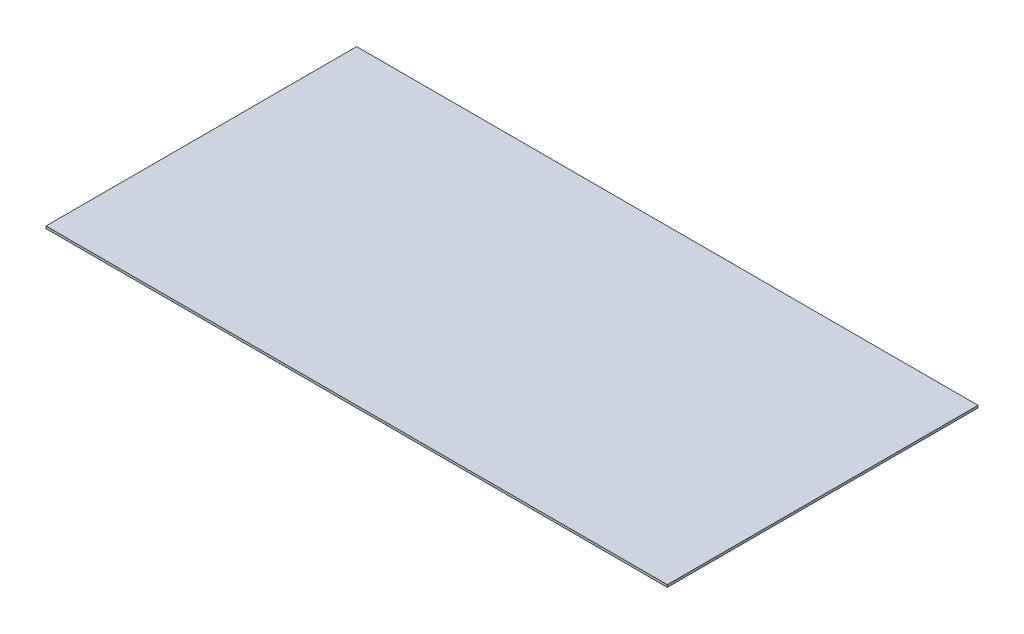
ISO-10303-21;
HEADER;
FILE_DESCRIPTION(('STEP AP214'),'2;1');
FILE_NAME('part.step','',(''),(''),'','','');
FILE_SCHEMA(('AUTOMOTIVE_DESIGN { 1 0 10303 214 1 1 1 1 }'));
ENDSEC;
DATA;
#1=APPLICATION_CONTEXT('core data for automotive mechanical design processes');
#2=APPLICATION_PROTOCOL_DEFINITION('international standard','automotive_design',2000,#1);
#3=PRODUCT_CONTEXT('',#1,'mechanical');
#4=PRODUCT('Part','Part','',(#3));
#5=PRODUCT_RELATED_PRODUCT_CATEGORY('part','',(#4));
#6=PRODUCT_DEFINITION_FORMATION('','',#4);
#7=PRODUCT_DEFINITION_CONTEXT('part definition',#1,'design');
#8=PRODUCT_DEFINITION('design','',#6,#7);
#9=PRODUCT_DEFINITION_SHAPE('','',#8);
#10=(LENGTH_UNIT() NAMED_UNIT(*) SI_UNIT(.MILLI.,.METRE.));
#11=(NAMED_UNIT(*) PLANE_ANGLE_UNIT() SI_UNIT($,.RADIAN.));
#12=(NAMED_UNIT(*) SI_UNIT($,.STERADIAN.) SOLID_ANGLE_UNIT());
#13=UNCERTAINTY_MEASURE_WITH_UNIT(LENGTH_MEASURE(1.E-05),#10,'distance_accuracy_value','');
#14=(GEOMETRIC_REPRESENTATION_CONTEXT(3) GLOBAL_UNCERTAINTY_ASSIGNED_CONTEXT((#13)) GLOBAL_UNIT_ASSIGNED_CONTEXT((#10,
#11,#12)) REPRESENTATION_CONTEXT('',''));
#15=CARTESIAN_POINT('',(0.,0.,0.));
#16=DIRECTION('',(0.,0.,1.));
#17=DIRECTION('',(1.,0.,0.));
#18=AXIS2_PLACEMENT_3D('',#15,#16,#17);
#19=CARTESIAN_POINT('',(0.,3.,0.));
#20=DIRECTION('',(1.,0.,0.));
#21=DIRECTION('',(0.,0.,-1.));
#22=AXIS2_PLACEMENT_3D('',#19,#20,#21);
#23=PLANE('',#22);
#24=DIRECTION('',(0.,0.,1.));
#25=VECTOR('',#24,1.);
#26=CARTESIAN_POINT('',(0.,0.,0.));
#27=LINE('',#26,#25);
#28=CARTESIAN_POINT('',(0.,0.,-400.));
#29=VERTEX_POINT('',#28);
#30=CARTESIAN_POINT('',(0.,0.,0.));
#31=VERTEX_POINT('',#30);
#32=EDGE_CURVE('E96',#29,#31,#27,.T.);
#33=ORIENTED_EDGE('',*,*,#32,.T.);
#34=DIRECTION('',(0.,-1.,0.));
#35=VECTOR('',#34,1.);
#36=CARTESIAN_POINT('',(0.,3.,0.));
#37=LINE('',#36,#35);
#38=CARTESIAN_POINT('',(0.,3.,0.));
#39=VERTEX_POINT('',#38);
#40=EDGE_CURVE('E11',#39,#31,#37,.T.);
#41=ORIENTED_EDGE('',*,*,#40,.F.);
#42=DIRECTION('',(0.,0.,1.));
#43=VECTOR('',#42,1.);
#44=CARTESIAN_POINT('',(0.,3.,0.));
#45=LINE('',#44,#43);
#46=CARTESIAN_POINT('',(0.,3.,-400.));
#47=VERTEX_POINT('',#46);
#48=EDGE_CURVE('E84',#47,#39,#45,.T.);
#49=ORIENTED_EDGE('',*,*,#48,.F.);
#50=DIRECTION('',(0.,-1.,0.));
#51=VECTOR('',#50,1.);
#52=CARTESIAN_POINT('',(0.,3.,-400.));
#53=LINE('',#52,#51);
#54=EDGE_CURVE('E92',#47,#29,#53,.T.);
#55=ORIENTED_EDGE('',*,*,#54,.T.);
#56=EDGE_LOOP('',(#33,#41,#49,#55));
#57=FACE_BOUND('',#56,.T.);
#58=ADVANCED_FACE('F33',(#57),#23,.F.);
#59=CARTESIAN_POINT('',(0.,3.,0.));
#60=DIRECTION('',(0.,0.,-1.));
#61=DIRECTION('',(-1.,0.,0.));
#62=AXIS2_PLACEMENT_3D('',#59,#60,#61);
#63=PLANE('',#62);
#64=DIRECTION('',(1.,0.,0.));
#65=VECTOR('',#64,1.);
#66=CARTESIAN_POINT('',(0.,0.,0.));
#67=LINE('',#66,#65);
#68=CARTESIAN_POINT('',(800.,0.,0.));
#69=VERTEX_POINT('',#68);
#70=EDGE_CURVE('E88',#31,#69,#67,.T.);
#71=ORIENTED_EDGE('',*,*,#70,.T.);
#72=DIRECTION('',(0.,-1.,0.));
#73=VECTOR('',#72,1.);
#74=CARTESIAN_POINT('',(800.,3.,0.));
#75=LINE('',#74,#73);
#76=CARTESIAN_POINT('',(800.,3.,0.));
#77=VERTEX_POINT('',#76);
#78=EDGE_CURVE('E41',#77,#69,#75,.T.);
#79=ORIENTED_EDGE('',*,*,#78,.F.);
#80=DIRECTION('',(1.,0.,0.));
#81=VECTOR('',#80,1.);
#82=CARTESIAN_POINT('',(0.,3.,0.));
#83=LINE('',#82,#81);
#84=EDGE_CURVE('E79',#39,#77,#83,.T.);
#85=ORIENTED_EDGE('',*,*,#84,.F.);
#86=ORIENTED_EDGE('',*,*,#40,.T.);
#87=EDGE_LOOP('',(#71,#79,#85,#86));
#88=FACE_BOUND('',#87,.T.);
#89=ADVANCED_FACE('F87',(#88),#63,.F.);
#90=CARTESIAN_POINT('',(800.,3.,0.));
#91=DIRECTION('',(-1.,0.,0.));
#92=DIRECTION('',(0.,0.,1.));
#93=AXIS2_PLACEMENT_3D('',#90,#91,#92);
#94=PLANE('',#93);
#95=DIRECTION('',(0.,0.,-1.));
#96=VECTOR('',#95,1.);
#97=CARTESIAN_POINT('',(800.,0.,0.));
#98=LINE('',#97,#96);
#99=CARTESIAN_POINT('',(800.,0.,-400.));
#100=VERTEX_POINT('',#99);
#101=EDGE_CURVE('E66',#69,#100,#98,.T.);
#102=ORIENTED_EDGE('',*,*,#101,.T.);
#103=DIRECTION('',(0.,-1.,0.));
#104=VECTOR('',#103,1.);
#105=CARTESIAN_POINT('',(800.,3.,-400.));
#106=LINE('',#105,#104);
#107=CARTESIAN_POINT('',(800.,3.,-400.));
#108=VERTEX_POINT('',#107);
#109=EDGE_CURVE('E89',#108,#100,#106,.T.);
#110=ORIENTED_EDGE('',*,*,#109,.F.);
#111=DIRECTION('',(0.,0.,-1.));
#112=VECTOR('',#111,1.);
#113=CARTESIAN_POINT('',(800.,3.,0.));
#114=LINE('',#113,#112);
#115=EDGE_CURVE('E82',#77,#108,#114,.T.);
#116=ORIENTED_EDGE('',*,*,#115,.F.);
#117=ORIENTED_EDGE('',*,*,#78,.T.);
#118=EDGE_LOOP('',(#102,#110,#116,#117));
#119=FACE_BOUND('',#118,.T.);
#120=ADVANCED_FACE('F90',(#119),#94,.F.);
#121=CARTESIAN_POINT('',(0.,3.,-400.));
#122=DIRECTION('',(0.,0.,1.));
#123=DIRECTION('',(1.,0.,0.));
#124=AXIS2_PLACEMENT_3D('',#121,#122,#123);
#125=PLANE('',#124);
#126=DIRECTION('',(-1.,0.,0.));
#127=VECTOR('',#126,1.);
#128=CARTESIAN_POINT('',(0.,0.,-400.));
#129=LINE('',#128,#127);
#130=EDGE_CURVE('E72',#100,#29,#129,.T.);
#131=ORIENTED_EDGE('',*,*,#130,.T.);
#132=ORIENTED_EDGE('',*,*,#54,.F.);
#133=DIRECTION('',(-1.,0.,0.));
#134=VECTOR('',#133,1.);
#135=CARTESIAN_POINT('',(0.,3.,-400.));
#136=LINE('',#135,#134);
#137=EDGE_CURVE('E49',#108,#47,#136,.T.);
#138=ORIENTED_EDGE('',*,*,#137,.F.);
#139=ORIENTED_EDGE('',*,*,#109,.T.);
#140=EDGE_LOOP('',(#131,#132,#138,#139));
#141=FACE_BOUND('',#140,.T.);
#142=ADVANCED_FACE('F103',(#141),#125,.F.);
#143=CARTESIAN_POINT('',(0.,3.,0.));
#144=DIRECTION('',(0.,-1.,0.));
#145=DIRECTION('',(0.,0.,-1.));
#146=AXIS2_PLACEMENT_3D('',#143,#144,#145);
#147=PLANE('',#146);
#148=ORIENTED_EDGE('',*,*,#48,.T.);
#149=ORIENTED_EDGE('',*,*,#84,.T.);
#150=ORIENTED_EDGE('',*,*,#115,.T.);
#151=ORIENTED_EDGE('',*,*,#137,.T.);
#152=EDGE_LOOP('',(#148,#149,#150,#151));
#153=FACE_BOUND('',#152,.T.);
#154=ADVANCED_FACE('F80',(#153),#147,.F.);
#155=CARTESIAN_POINT('',(0.,0.,0.));
#156=DIRECTION('',(0.,-1.,0.));
#157=DIRECTION('',(0.,0.,-1.));
#158=AXIS2_PLACEMENT_3D('',#155,#156,#157);
#159=PLANE('',#158);
#160=ORIENTED_EDGE('',*,*,#32,.F.);
#161=ORIENTED_EDGE('',*,*,#130,.F.);
#162=ORIENTED_EDGE('',*,*,#101,.F.);
#163=ORIENTED_EDGE('',*,*,#70,.F.);
#164=EDGE_LOOP('',(#160,#161,#162,#163));
#165=FACE_BOUND('',#164,.T.);
#166=ADVANCED_FACE('F106',(#165),#159,.T.);
#167=CLOSED_SHELL('',(#58,#89,#120,#142,#154,#166));
#168=MANIFOLD_SOLID_BREP('B2',#167);
#169=ADVANCED_BREP_SHAPE_REPRESENTATION('',(#18,#168),#14);
#170=SHAPE_DEFINITION_REPRESENTATION(#9,#169);
ENDSEC;
END-ISO-10303-21;
